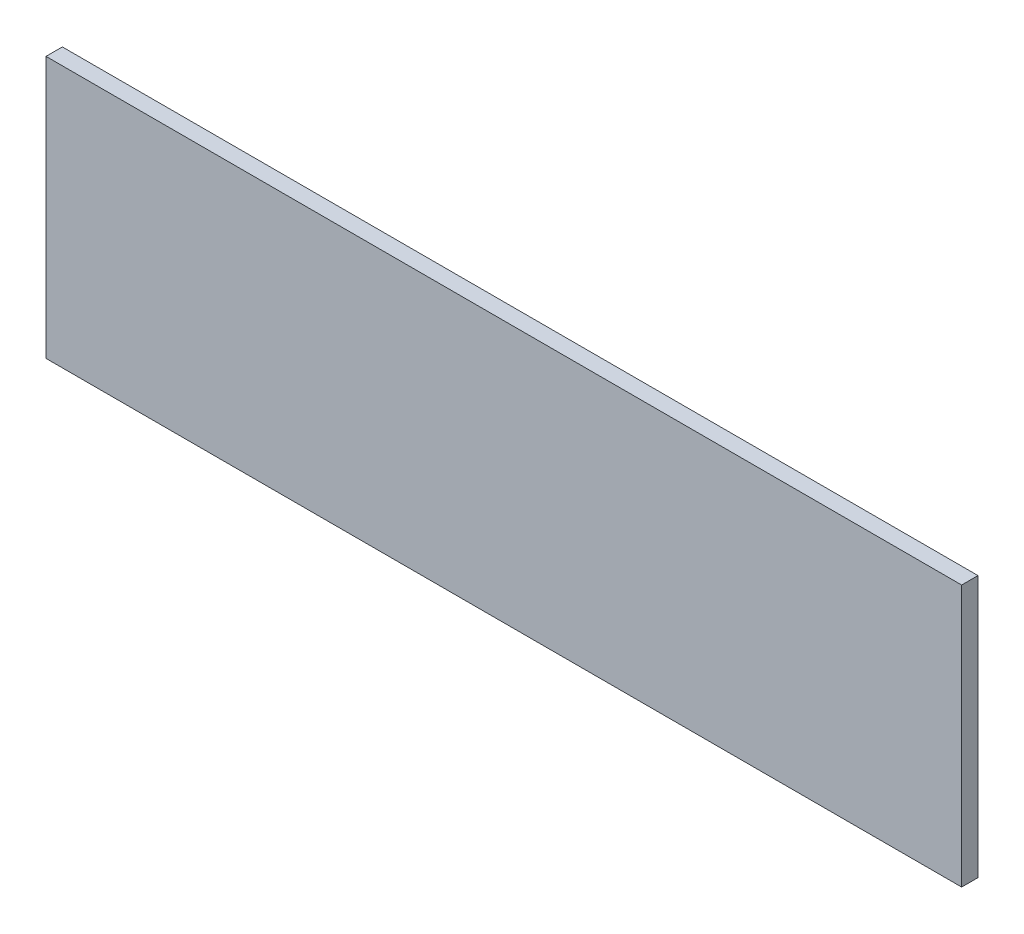
ISO-10303-21;
HEADER;
FILE_DESCRIPTION(('STEP AP214'),'2;1');
FILE_NAME('part.step','',(''),(''),'','','');
FILE_SCHEMA(('AUTOMOTIVE_DESIGN { 1 0 10303 214 1 1 1 1 }'));
ENDSEC;
DATA;
#1=APPLICATION_CONTEXT('core data for automotive mechanical design processes');
#2=APPLICATION_PROTOCOL_DEFINITION('international standard','automotive_design',2000,#1);
#3=PRODUCT_CONTEXT('',#1,'mechanical');
#4=PRODUCT('Part','Part','',(#3));
#5=PRODUCT_RELATED_PRODUCT_CATEGORY('part','',(#4));
#6=PRODUCT_DEFINITION_FORMATION('','',#4);
#7=PRODUCT_DEFINITION_CONTEXT('part definition',#1,'design');
#8=PRODUCT_DEFINITION('design','',#6,#7);
#9=PRODUCT_DEFINITION_SHAPE('','',#8);
#10=(LENGTH_UNIT() NAMED_UNIT(*) SI_UNIT(.MILLI.,.METRE.));
#11=(NAMED_UNIT(*) PLANE_ANGLE_UNIT() SI_UNIT($,.RADIAN.));
#12=(NAMED_UNIT(*) SI_UNIT($,.STERADIAN.) SOLID_ANGLE_UNIT());
#13=UNCERTAINTY_MEASURE_WITH_UNIT(LENGTH_MEASURE(1.E-05),#10,'distance_accuracy_value','');
#14=(GEOMETRIC_REPRESENTATION_CONTEXT(3) GLOBAL_UNCERTAINTY_ASSIGNED_CONTEXT((#13)) GLOBAL_UNIT_ASSIGNED_CONTEXT((#10,
#11,#12)) REPRESENTATION_CONTEXT('',''));
#15=CARTESIAN_POINT('',(0.,0.,0.));
#16=DIRECTION('',(0.,0.,1.));
#17=DIRECTION('',(1.,0.,0.));
#18=AXIS2_PLACEMENT_3D('',#15,#16,#17);
#19=CARTESIAN_POINT('',(0.,0.,3.175));
#20=DIRECTION('',(1.,0.,0.));
#21=DIRECTION('',(0.,0.,-1.));
#22=AXIS2_PLACEMENT_3D('',#19,#20,#21);
#23=PLANE('',#22);
#24=DIRECTION('',(0.,-1.,0.));
#25=VECTOR('',#24,1.);
#26=CARTESIAN_POINT('',(0.,0.,0.));
#27=LINE('',#26,#25);
#28=CARTESIAN_POINT('',(0.,50.8,0.));
#29=VERTEX_POINT('',#28);
#30=CARTESIAN_POINT('',(0.,0.,0.));
#31=VERTEX_POINT('',#30);
#32=EDGE_CURVE('E98',#29,#31,#27,.T.);
#33=ORIENTED_EDGE('',*,*,#32,.T.);
#34=DIRECTION('',(0.,0.,-1.));
#35=VECTOR('',#34,1.);
#36=CARTESIAN_POINT('',(0.,0.,3.175));
#37=LINE('',#36,#35);
#38=CARTESIAN_POINT('',(0.,0.,3.175));
#39=VERTEX_POINT('',#38);
#40=EDGE_CURVE('E11',#39,#31,#37,.T.);
#41=ORIENTED_EDGE('',*,*,#40,.F.);
#42=DIRECTION('',(0.,-1.,0.));
#43=VECTOR('',#42,1.);
#44=CARTESIAN_POINT('',(0.,0.,3.175));
#45=LINE('',#44,#43);
#46=CARTESIAN_POINT('',(0.,50.8,3.175));
#47=VERTEX_POINT('',#46);
#48=EDGE_CURVE('E86',#47,#39,#45,.T.);
#49=ORIENTED_EDGE('',*,*,#48,.F.);
#50=DIRECTION('',(0.,0.,-1.));
#51=VECTOR('',#50,1.);
#52=CARTESIAN_POINT('',(0.,50.8,3.175));
#53=LINE('',#52,#51);
#54=EDGE_CURVE('E94',#47,#29,#53,.T.);
#55=ORIENTED_EDGE('',*,*,#54,.T.);
#56=EDGE_LOOP('',(#33,#41,#49,#55));
#57=FACE_BOUND('',#56,.T.);
#58=ADVANCED_FACE('F35',(#57),#23,.F.);
#59=CARTESIAN_POINT('',(0.,0.,3.175));
#60=DIRECTION('',(0.,1.,0.));
#61=DIRECTION('',(0.,0.,1.));
#62=AXIS2_PLACEMENT_3D('',#59,#60,#61);
#63=PLANE('',#62);
#64=DIRECTION('',(1.,0.,0.));
#65=VECTOR('',#64,1.);
#66=CARTESIAN_POINT('',(0.,0.,0.));
#67=LINE('',#66,#65);
#68=CARTESIAN_POINT('',(177.8,0.,0.));
#69=VERTEX_POINT('',#68);
#70=EDGE_CURVE('E90',#31,#69,#67,.T.);
#71=ORIENTED_EDGE('',*,*,#70,.T.);
#72=DIRECTION('',(0.,0.,-1.));
#73=VECTOR('',#72,1.);
#74=CARTESIAN_POINT('',(177.8,0.,3.175));
#75=LINE('',#74,#73);
#76=CARTESIAN_POINT('',(177.8,0.,3.175));
#77=VERTEX_POINT('',#76);
#78=EDGE_CURVE('E43',#77,#69,#75,.T.);
#79=ORIENTED_EDGE('',*,*,#78,.F.);
#80=DIRECTION('',(1.,0.,0.));
#81=VECTOR('',#80,1.);
#82=CARTESIAN_POINT('',(0.,0.,3.175));
#83=LINE('',#82,#81);
#84=EDGE_CURVE('E81',#39,#77,#83,.T.);
#85=ORIENTED_EDGE('',*,*,#84,.F.);
#86=ORIENTED_EDGE('',*,*,#40,.T.);
#87=EDGE_LOOP('',(#71,#79,#85,#86));
#88=FACE_BOUND('',#87,.T.);
#89=ADVANCED_FACE('F89',(#88),#63,.F.);
#90=CARTESIAN_POINT('',(177.8,0.,3.175));
#91=DIRECTION('',(-1.,0.,0.));
#92=DIRECTION('',(0.,0.,1.));
#93=AXIS2_PLACEMENT_3D('',#90,#91,#92);
#94=PLANE('',#93);
#95=DIRECTION('',(0.,1.,0.));
#96=VECTOR('',#95,1.);
#97=CARTESIAN_POINT('',(177.8,0.,0.));
#98=LINE('',#97,#96);
#99=CARTESIAN_POINT('',(177.8,50.8,0.));
#100=VERTEX_POINT('',#99);
#101=EDGE_CURVE('E68',#69,#100,#98,.T.);
#102=ORIENTED_EDGE('',*,*,#101,.T.);
#103=DIRECTION('',(0.,0.,-1.));
#104=VECTOR('',#103,1.);
#105=CARTESIAN_POINT('',(177.8,50.8,3.175));
#106=LINE('',#105,#104);
#107=CARTESIAN_POINT('',(177.8,50.8,3.175));
#108=VERTEX_POINT('',#107);
#109=EDGE_CURVE('E91',#108,#100,#106,.T.);
#110=ORIENTED_EDGE('',*,*,#109,.F.);
#111=DIRECTION('',(0.,1.,0.));
#112=VECTOR('',#111,1.);
#113=CARTESIAN_POINT('',(177.8,0.,3.175));
#114=LINE('',#113,#112);
#115=EDGE_CURVE('E84',#77,#108,#114,.T.);
#116=ORIENTED_EDGE('',*,*,#115,.F.);
#117=ORIENTED_EDGE('',*,*,#78,.T.);
#118=EDGE_LOOP('',(#102,#110,#116,#117));
#119=FACE_BOUND('',#118,.T.);
#120=ADVANCED_FACE('F92',(#119),#94,.F.);
#121=CARTESIAN_POINT('',(0.,50.8,3.175));
#122=DIRECTION('',(0.,-1.,0.));
#123=DIRECTION('',(0.,0.,-1.));
#124=AXIS2_PLACEMENT_3D('',#121,#122,#123);
#125=PLANE('',#124);
#126=DIRECTION('',(-1.,0.,0.));
#127=VECTOR('',#126,1.);
#128=CARTESIAN_POINT('',(0.,50.8,0.));
#129=LINE('',#128,#127);
#130=EDGE_CURVE('E74',#100,#29,#129,.T.);
#131=ORIENTED_EDGE('',*,*,#130,.T.);
#132=ORIENTED_EDGE('',*,*,#54,.F.);
#133=DIRECTION('',(-1.,0.,0.));
#134=VECTOR('',#133,1.);
#135=CARTESIAN_POINT('',(0.,50.8,3.175));
#136=LINE('',#135,#134);
#137=EDGE_CURVE('E51',#108,#47,#136,.T.);
#138=ORIENTED_EDGE('',*,*,#137,.F.);
#139=ORIENTED_EDGE('',*,*,#109,.T.);
#140=EDGE_LOOP('',(#131,#132,#138,#139));
#141=FACE_BOUND('',#140,.T.);
#142=ADVANCED_FACE('F105',(#141),#125,.F.);
#143=CARTESIAN_POINT('',(0.,0.,3.175));
#144=DIRECTION('',(0.,0.,-1.));
#145=DIRECTION('',(-1.,0.,0.));
#146=AXIS2_PLACEMENT_3D('',#143,#144,#145);
#147=PLANE('',#146);
#148=ORIENTED_EDGE('',*,*,#48,.T.);
#149=ORIENTED_EDGE('',*,*,#84,.T.);
#150=ORIENTED_EDGE('',*,*,#115,.T.);
#151=ORIENTED_EDGE('',*,*,#137,.T.);
#152=EDGE_LOOP('',(#148,#149,#150,#151));
#153=FACE_BOUND('',#152,.T.);
#154=ADVANCED_FACE('F82',(#153),#147,.F.);
#155=CARTESIAN_POINT('',(0.,0.,0.));
#156=DIRECTION('',(0.,0.,-1.));
#157=DIRECTION('',(-1.,0.,0.));
#158=AXIS2_PLACEMENT_3D('',#155,#156,#157);
#159=PLANE('',#158);
#160=ORIENTED_EDGE('',*,*,#32,.F.);
#161=ORIENTED_EDGE('',*,*,#130,.F.);
#162=ORIENTED_EDGE('',*,*,#101,.F.);
#163=ORIENTED_EDGE('',*,*,#70,.F.);
#164=EDGE_LOOP('',(#160,#161,#162,#163));
#165=FACE_BOUND('',#164,.T.);
#166=ADVANCED_FACE('F108',(#165),#159,.T.);
#167=CLOSED_SHELL('',(#58,#89,#120,#142,#154,#166));
#168=MANIFOLD_SOLID_BREP('B2',#167);
#169=ADVANCED_BREP_SHAPE_REPRESENTATION('',(#18,#168),#14);
#170=SHAPE_DEFINITION_REPRESENTATION(#9,#169);
ENDSEC;
END-ISO-10303-21;
